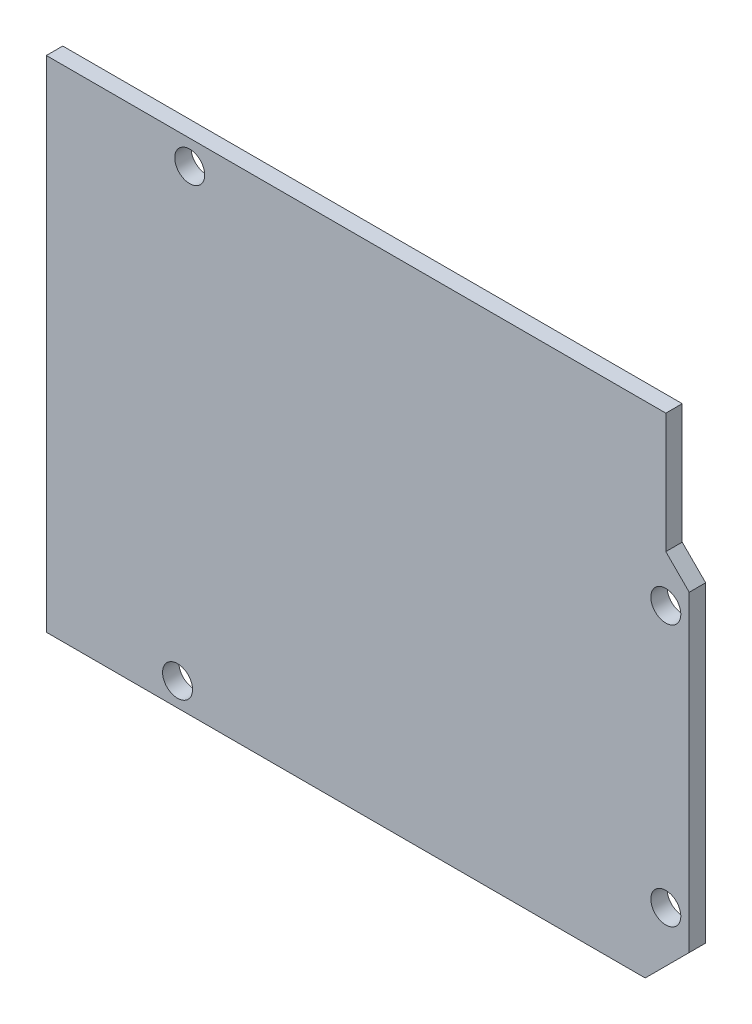
ISO-10303-21;
HEADER;
FILE_DESCRIPTION(('STEP AP214'),'2;1');
FILE_NAME('part.step','',(''),(''),'','','');
FILE_SCHEMA(('AUTOMOTIVE_DESIGN { 1 0 10303 214 1 1 1 1 }'));
ENDSEC;
DATA;
#1=APPLICATION_CONTEXT('core data for automotive mechanical design processes');
#2=APPLICATION_PROTOCOL_DEFINITION('international standard','automotive_design',2000,#1);
#3=PRODUCT_CONTEXT('',#1,'mechanical');
#4=PRODUCT('Part','Part','',(#3));
#5=PRODUCT_RELATED_PRODUCT_CATEGORY('part','',(#4));
#6=PRODUCT_DEFINITION_FORMATION('','',#4);
#7=PRODUCT_DEFINITION_CONTEXT('part definition',#1,'design');
#8=PRODUCT_DEFINITION('design','',#6,#7);
#9=PRODUCT_DEFINITION_SHAPE('','',#8);
#10=(LENGTH_UNIT() NAMED_UNIT(*) SI_UNIT(.MILLI.,.METRE.));
#11=(NAMED_UNIT(*) PLANE_ANGLE_UNIT() SI_UNIT($,.RADIAN.));
#12=(NAMED_UNIT(*) SI_UNIT($,.STERADIAN.) SOLID_ANGLE_UNIT());
#13=UNCERTAINTY_MEASURE_WITH_UNIT(LENGTH_MEASURE(1.E-05),#10,'distance_accuracy_value','');
#14=(GEOMETRIC_REPRESENTATION_CONTEXT(3) GLOBAL_UNCERTAINTY_ASSIGNED_CONTEXT((#13)) GLOBAL_UNIT_ASSIGNED_CONTEXT((#10,
#11,#12)) REPRESENTATION_CONTEXT('',''));
#15=CARTESIAN_POINT('',(0.,0.,0.));
#16=DIRECTION('',(0.,0.,1.));
#17=DIRECTION('',(1.,0.,0.));
#18=AXIS2_PLACEMENT_3D('',#15,#16,#17);
#19=CARTESIAN_POINT('',(34.3,-26.65,1.75));
#20=DIRECTION('',(-1.,0.,0.));
#21=DIRECTION('',(0.,0.,1.));
#22=AXIS2_PLACEMENT_3D('',#19,#20,#21);
#23=PLANE('',#22);
#24=DIRECTION('',(0.,1.,0.));
#25=VECTOR('',#24,1.);
#26=CARTESIAN_POINT('',(34.3,-26.65,1.75));
#27=LINE('',#26,#25);
#28=CARTESIAN_POINT('',(34.3,-21.9497652203467,1.75));
#29=VERTEX_POINT('',#28);
#30=CARTESIAN_POINT('',(34.3,11.35,1.75));
#31=VERTEX_POINT('',#30);
#32=EDGE_CURVE('E123',#29,#31,#27,.T.);
#33=ORIENTED_EDGE('',*,*,#32,.F.);
#34=DIRECTION('',(0.,0.,-1.));
#35=VECTOR('',#34,1.);
#36=CARTESIAN_POINT('',(34.3,-21.9497652203467,1.75));
#37=LINE('',#36,#35);
#38=CARTESIAN_POINT('',(34.3,-21.9497652203467,0.));
#39=VERTEX_POINT('',#38);
#40=EDGE_CURVE('E161',#29,#39,#37,.T.);
#41=ORIENTED_EDGE('',*,*,#40,.T.);
#42=DIRECTION('',(0.,1.,0.));
#43=VECTOR('',#42,1.);
#44=CARTESIAN_POINT('',(34.3,-26.65,0.));
#45=LINE('',#44,#43);
#46=CARTESIAN_POINT('',(34.3,11.35,0.));
#47=VERTEX_POINT('',#46);
#48=EDGE_CURVE('E112',#39,#47,#45,.T.);
#49=ORIENTED_EDGE('',*,*,#48,.T.);
#50=DIRECTION('',(0.,0.,1.));
#51=VECTOR('',#50,1.);
#52=CARTESIAN_POINT('',(34.3,11.35,1.75));
#53=LINE('',#52,#51);
#54=EDGE_CURVE('E167',#47,#31,#53,.T.);
#55=ORIENTED_EDGE('',*,*,#54,.T.);
#56=EDGE_LOOP('',(#33,#41,#49,#55));
#57=FACE_BOUND('',#56,.T.);
#58=ADVANCED_FACE('F32',(#57),#23,.F.);
#59=CARTESIAN_POINT('',(-34.3,26.65,1.75));
#60=DIRECTION('',(0.,-1.,0.));
#61=DIRECTION('',(0.,0.,-1.));
#62=AXIS2_PLACEMENT_3D('',#59,#60,#61);
#63=PLANE('',#62);
#64=DIRECTION('',(-1.,0.,0.));
#65=VECTOR('',#64,1.);
#66=CARTESIAN_POINT('',(-34.3,26.65,1.75));
#67=LINE('',#66,#65);
#68=CARTESIAN_POINT('',(31.8,26.65,1.75));
#69=VERTEX_POINT('',#68);
#70=CARTESIAN_POINT('',(-34.3,26.65,1.75));
#71=VERTEX_POINT('',#70);
#72=EDGE_CURVE('E105',#69,#71,#67,.T.);
#73=ORIENTED_EDGE('',*,*,#72,.F.);
#74=DIRECTION('',(0.,0.,1.));
#75=VECTOR('',#74,1.);
#76=CARTESIAN_POINT('',(31.8,26.65,0.));
#77=LINE('',#76,#75);
#78=CARTESIAN_POINT('',(31.8,26.65,0.));
#79=VERTEX_POINT('',#78);
#80=EDGE_CURVE('E92',#79,#69,#77,.T.);
#81=ORIENTED_EDGE('',*,*,#80,.F.);
#82=DIRECTION('',(-1.,0.,0.));
#83=VECTOR('',#82,1.);
#84=CARTESIAN_POINT('',(-34.3,26.65,0.));
#85=LINE('',#84,#83);
#86=CARTESIAN_POINT('',(-34.3,26.65,0.));
#87=VERTEX_POINT('',#86);
#88=EDGE_CURVE('E103',#79,#87,#85,.T.);
#89=ORIENTED_EDGE('',*,*,#88,.T.);
#90=DIRECTION('',(0.,0.,-1.));
#91=VECTOR('',#90,1.);
#92=CARTESIAN_POINT('',(-34.3,26.65,1.75));
#93=LINE('',#92,#91);
#94=EDGE_CURVE('E39',#71,#87,#93,.T.);
#95=ORIENTED_EDGE('',*,*,#94,.F.);
#96=EDGE_LOOP('',(#73,#81,#89,#95));
#97=FACE_BOUND('',#96,.T.);
#98=ADVANCED_FACE('F101',(#97),#63,.F.);
#99=CARTESIAN_POINT('',(-34.3,-26.65,1.75));
#100=DIRECTION('',(1.,0.,0.));
#101=DIRECTION('',(0.,0.,-1.));
#102=AXIS2_PLACEMENT_3D('',#99,#100,#101);
#103=PLANE('',#102);
#104=DIRECTION('',(0.,-1.,0.));
#105=VECTOR('',#104,1.);
#106=CARTESIAN_POINT('',(-34.3,-26.65,0.));
#107=LINE('',#106,#105);
#108=CARTESIAN_POINT('',(-34.3,-26.65,0.));
#109=VERTEX_POINT('',#108);
#110=EDGE_CURVE('E111',#87,#109,#107,.T.);
#111=ORIENTED_EDGE('',*,*,#110,.T.);
#112=DIRECTION('',(0.,0.,-1.));
#113=VECTOR('',#112,1.);
#114=CARTESIAN_POINT('',(-34.3,-26.65,1.75));
#115=LINE('',#114,#113);
#116=CARTESIAN_POINT('',(-34.3,-26.65,1.75));
#117=VERTEX_POINT('',#116);
#118=EDGE_CURVE('E124',#117,#109,#115,.T.);
#119=ORIENTED_EDGE('',*,*,#118,.F.);
#120=DIRECTION('',(0.,-1.,0.));
#121=VECTOR('',#120,1.);
#122=CARTESIAN_POINT('',(-34.3,-26.65,1.75));
#123=LINE('',#122,#121);
#124=EDGE_CURVE('E131',#71,#117,#123,.T.);
#125=ORIENTED_EDGE('',*,*,#124,.F.);
#126=ORIENTED_EDGE('',*,*,#94,.T.);
#127=EDGE_LOOP('',(#111,#119,#125,#126));
#128=FACE_BOUND('',#127,.T.);
#129=ADVANCED_FACE('F129',(#128),#103,.F.);
#130=CARTESIAN_POINT('',(-34.3,-26.65,1.75));
#131=DIRECTION('',(0.,1.,0.));
#132=DIRECTION('',(0.,0.,1.));
#133=AXIS2_PLACEMENT_3D('',#130,#131,#132);
#134=PLANE('',#133);
#135=DIRECTION('',(1.,0.,0.));
#136=VECTOR('',#135,1.);
#137=CARTESIAN_POINT('',(-34.3,-26.65,0.));
#138=LINE('',#137,#136);
#139=CARTESIAN_POINT('',(29.5997652203467,-26.65,0.));
#140=VERTEX_POINT('',#139);
#141=EDGE_CURVE('E114',#109,#140,#138,.T.);
#142=ORIENTED_EDGE('',*,*,#141,.T.);
#143=DIRECTION('',(0.,0.,1.));
#144=VECTOR('',#143,1.);
#145=CARTESIAN_POINT('',(29.5997652203467,-26.65,1.75));
#146=LINE('',#145,#144);
#147=CARTESIAN_POINT('',(29.5997652203467,-26.65,1.75));
#148=VERTEX_POINT('',#147);
#149=EDGE_CURVE('E53',#140,#148,#146,.T.);
#150=ORIENTED_EDGE('',*,*,#149,.T.);
#151=DIRECTION('',(1.,0.,0.));
#152=VECTOR('',#151,1.);
#153=CARTESIAN_POINT('',(-34.3,-26.65,1.75));
#154=LINE('',#153,#152);
#155=EDGE_CURVE('E126',#117,#148,#154,.T.);
#156=ORIENTED_EDGE('',*,*,#155,.F.);
#157=ORIENTED_EDGE('',*,*,#118,.T.);
#158=EDGE_LOOP('',(#142,#150,#156,#157));
#159=FACE_BOUND('',#158,.T.);
#160=ADVANCED_FACE('F184',(#159),#134,.F.);
#161=CARTESIAN_POINT('',(0.,0.,1.75));
#162=DIRECTION('',(0.,0.,-1.));
#163=DIRECTION('',(-1.,0.,0.));
#164=AXIS2_PLACEMENT_3D('',#161,#162,#163);
#165=PLANE('',#164);
#166=CARTESIAN_POINT('',(31.8,-19.05,1.75));
#167=DIRECTION('',(0.,0.,1.));
#168=DIRECTION('',(1.,0.,0.));
#169=AXIS2_PLACEMENT_3D('',#166,#167,#168);
#170=CIRCLE('',#169,1.6);
#171=CARTESIAN_POINT('',(33.4,-19.05,1.75));
#172=VERTEX_POINT('',#171);
#173=EDGE_CURVE('E158',#172,#172,#170,.T.);
#174=ORIENTED_EDGE('',*,*,#173,.F.);
#175=EDGE_LOOP('',(#174));
#176=FACE_BOUND('',#175,.T.);
#177=CARTESIAN_POINT('',(31.8,8.84999999999999,1.75));
#178=DIRECTION('',(0.,0.,1.));
#179=DIRECTION('',(1.,0.,0.));
#180=AXIS2_PLACEMENT_3D('',#177,#178,#179);
#181=CIRCLE('',#180,1.6);
#182=CARTESIAN_POINT('',(33.4,8.84999999999999,1.75));
#183=VERTEX_POINT('',#182);
#184=EDGE_CURVE('E152',#183,#183,#181,.T.);
#185=ORIENTED_EDGE('',*,*,#184,.F.);
#186=EDGE_LOOP('',(#185));
#187=FACE_BOUND('',#186,.T.);
#188=CARTESIAN_POINT('',(-20.3,-24.15,1.75));
#189=DIRECTION('',(0.,0.,1.));
#190=DIRECTION('',(1.,0.,0.));
#191=AXIS2_PLACEMENT_3D('',#188,#189,#190);
#192=CIRCLE('',#191,1.6);
#193=CARTESIAN_POINT('',(-18.7,-24.15,1.75));
#194=VERTEX_POINT('',#193);
#195=EDGE_CURVE('E146',#194,#194,#192,.T.);
#196=ORIENTED_EDGE('',*,*,#195,.F.);
#197=EDGE_LOOP('',(#196));
#198=FACE_BOUND('',#197,.T.);
#199=CARTESIAN_POINT('',(-19.,24.05,1.75));
#200=DIRECTION('',(0.,0.,1.));
#201=DIRECTION('',(1.,0.,0.));
#202=AXIS2_PLACEMENT_3D('',#199,#200,#201);
#203=CIRCLE('',#202,1.6);
#204=CARTESIAN_POINT('',(-17.4,24.05,1.75));
#205=VERTEX_POINT('',#204);
#206=EDGE_CURVE('E140',#205,#205,#203,.T.);
#207=ORIENTED_EDGE('',*,*,#206,.F.);
#208=EDGE_LOOP('',(#207));
#209=FACE_BOUND('',#208,.T.);
#210=ORIENTED_EDGE('',*,*,#155,.T.);
#211=DIRECTION('',(-0.707106781186546,-0.707106781186549,0.));
#212=VECTOR('',#211,1.);
#213=CARTESIAN_POINT('',(50.9498826101734,-5.29988261017329,1.75));
#214=LINE('',#213,#212);
#215=EDGE_CURVE('E97',#29,#148,#214,.T.);
#216=ORIENTED_EDGE('',*,*,#215,.F.);
#217=ORIENTED_EDGE('',*,*,#32,.T.);
#218=DIRECTION('',(0.707106781186549,-0.707106781186546,0.));
#219=VECTOR('',#218,1.);
#220=CARTESIAN_POINT('',(31.8,13.85,1.75));
#221=LINE('',#220,#219);
#222=CARTESIAN_POINT('',(31.8,13.85,1.75));
#223=VERTEX_POINT('',#222);
#224=EDGE_CURVE('E172',#223,#31,#221,.T.);
#225=ORIENTED_EDGE('',*,*,#224,.F.);
#226=DIRECTION('',(0.,-1.,0.));
#227=VECTOR('',#226,1.);
#228=CARTESIAN_POINT('',(31.8,26.65,1.75));
#229=LINE('',#228,#227);
#230=EDGE_CURVE('E174',#69,#223,#229,.T.);
#231=ORIENTED_EDGE('',*,*,#230,.F.);
#232=ORIENTED_EDGE('',*,*,#72,.T.);
#233=ORIENTED_EDGE('',*,*,#124,.T.);
#234=EDGE_LOOP('',(#210,#216,#217,#225,#231,#232,#233));
#235=FACE_BOUND('',#234,.T.);
#236=ADVANCED_FACE('F181',(#176,#187,#198,#209,#235),#165,.F.);
#237=CARTESIAN_POINT('',(0.,0.,0.));
#238=DIRECTION('',(0.,0.,-1.));
#239=DIRECTION('',(-1.,0.,0.));
#240=AXIS2_PLACEMENT_3D('',#237,#238,#239);
#241=PLANE('',#240);
#242=DIRECTION('',(0.707106781186546,0.707106781186549,0.));
#243=VECTOR('',#242,1.);
#244=CARTESIAN_POINT('',(28.1248826101734,-28.1248826101733,0.));
#245=LINE('',#244,#243);
#246=EDGE_CURVE('E11',#140,#39,#245,.T.);
#247=ORIENTED_EDGE('',*,*,#246,.F.);
#248=ORIENTED_EDGE('',*,*,#141,.F.);
#249=ORIENTED_EDGE('',*,*,#110,.F.);
#250=ORIENTED_EDGE('',*,*,#88,.F.);
#251=DIRECTION('',(0.,-1.,0.));
#252=VECTOR('',#251,1.);
#253=CARTESIAN_POINT('',(31.8,26.65,0.));
#254=LINE('',#253,#252);
#255=CARTESIAN_POINT('',(31.8,13.85,0.));
#256=VERTEX_POINT('',#255);
#257=EDGE_CURVE('E88',#79,#256,#254,.T.);
#258=ORIENTED_EDGE('',*,*,#257,.T.);
#259=DIRECTION('',(0.707106781186549,-0.707106781186546,0.));
#260=VECTOR('',#259,1.);
#261=CARTESIAN_POINT('',(31.8,13.85,0.));
#262=LINE('',#261,#260);
#263=EDGE_CURVE('E46',#256,#47,#262,.T.);
#264=ORIENTED_EDGE('',*,*,#263,.T.);
#265=ORIENTED_EDGE('',*,*,#48,.F.);
#266=EDGE_LOOP('',(#247,#248,#249,#250,#258,#264,#265));
#267=FACE_BOUND('',#266,.T.);
#268=CARTESIAN_POINT('',(31.8,-19.05,0.));
#269=DIRECTION('',(0.,0.,1.));
#270=DIRECTION('',(1.,0.,0.));
#271=AXIS2_PLACEMENT_3D('',#268,#269,#270);
#272=CIRCLE('',#271,1.6);
#273=CARTESIAN_POINT('',(33.4,-19.05,0.));
#274=VERTEX_POINT('',#273);
#275=EDGE_CURVE('E155',#274,#274,#272,.T.);
#276=ORIENTED_EDGE('',*,*,#275,.T.);
#277=EDGE_LOOP('',(#276));
#278=FACE_BOUND('',#277,.T.);
#279=CARTESIAN_POINT('',(31.8,8.84999999999999,0.));
#280=DIRECTION('',(0.,0.,1.));
#281=DIRECTION('',(1.,0.,0.));
#282=AXIS2_PLACEMENT_3D('',#279,#280,#281);
#283=CIRCLE('',#282,1.6);
#284=CARTESIAN_POINT('',(33.4,8.84999999999999,0.));
#285=VERTEX_POINT('',#284);
#286=EDGE_CURVE('E149',#285,#285,#283,.T.);
#287=ORIENTED_EDGE('',*,*,#286,.T.);
#288=EDGE_LOOP('',(#287));
#289=FACE_BOUND('',#288,.T.);
#290=CARTESIAN_POINT('',(-20.3,-24.15,0.));
#291=DIRECTION('',(0.,0.,1.));
#292=DIRECTION('',(1.,0.,0.));
#293=AXIS2_PLACEMENT_3D('',#290,#291,#292);
#294=CIRCLE('',#293,1.6);
#295=CARTESIAN_POINT('',(-18.7,-24.15,0.));
#296=VERTEX_POINT('',#295);
#297=EDGE_CURVE('E143',#296,#296,#294,.T.);
#298=ORIENTED_EDGE('',*,*,#297,.T.);
#299=EDGE_LOOP('',(#298));
#300=FACE_BOUND('',#299,.T.);
#301=CARTESIAN_POINT('',(-19.,24.05,0.));
#302=DIRECTION('',(0.,0.,1.));
#303=DIRECTION('',(1.,0.,0.));
#304=AXIS2_PLACEMENT_3D('',#301,#302,#303);
#305=CIRCLE('',#304,1.6);
#306=CARTESIAN_POINT('',(-17.4,24.05,0.));
#307=VERTEX_POINT('',#306);
#308=EDGE_CURVE('E117',#307,#307,#305,.T.);
#309=ORIENTED_EDGE('',*,*,#308,.T.);
#310=EDGE_LOOP('',(#309));
#311=FACE_BOUND('',#310,.T.);
#312=ADVANCED_FACE('F108',(#267,#278,#289,#300,#311),#241,.T.);
#313=CARTESIAN_POINT('',(-19.,24.05,0.));
#314=DIRECTION('',(0.,0.,1.));
#315=DIRECTION('',(1.,0.,0.));
#316=AXIS2_PLACEMENT_3D('',#313,#314,#315);
#317=CYLINDRICAL_SURFACE('',#316,1.6);
#318=ORIENTED_EDGE('',*,*,#308,.F.);
#319=EDGE_LOOP('',(#318));
#320=FACE_BOUND('',#319,.T.);
#321=ORIENTED_EDGE('',*,*,#206,.T.);
#322=EDGE_LOOP('',(#321));
#323=FACE_BOUND('',#322,.T.);
#324=ADVANCED_FACE('F211',(#320,#323),#317,.F.);
#325=CARTESIAN_POINT('',(-20.3,-24.15,0.));
#326=DIRECTION('',(0.,0.,1.));
#327=DIRECTION('',(1.,0.,0.));
#328=AXIS2_PLACEMENT_3D('',#325,#326,#327);
#329=CYLINDRICAL_SURFACE('',#328,1.6);
#330=ORIENTED_EDGE('',*,*,#297,.F.);
#331=EDGE_LOOP('',(#330));
#332=FACE_BOUND('',#331,.T.);
#333=ORIENTED_EDGE('',*,*,#195,.T.);
#334=EDGE_LOOP('',(#333));
#335=FACE_BOUND('',#334,.T.);
#336=ADVANCED_FACE('F216',(#332,#335),#329,.F.);
#337=CARTESIAN_POINT('',(31.8,8.84999999999999,0.));
#338=DIRECTION('',(0.,0.,1.));
#339=DIRECTION('',(1.,0.,0.));
#340=AXIS2_PLACEMENT_3D('',#337,#338,#339);
#341=CYLINDRICAL_SURFACE('',#340,1.6);
#342=ORIENTED_EDGE('',*,*,#286,.F.);
#343=EDGE_LOOP('',(#342));
#344=FACE_BOUND('',#343,.T.);
#345=ORIENTED_EDGE('',*,*,#184,.T.);
#346=EDGE_LOOP('',(#345));
#347=FACE_BOUND('',#346,.T.);
#348=ADVANCED_FACE('F228',(#344,#347),#341,.F.);
#349=CARTESIAN_POINT('',(31.8,-19.05,0.));
#350=DIRECTION('',(0.,0.,1.));
#351=DIRECTION('',(1.,0.,0.));
#352=AXIS2_PLACEMENT_3D('',#349,#350,#351);
#353=CYLINDRICAL_SURFACE('',#352,1.6);
#354=ORIENTED_EDGE('',*,*,#275,.F.);
#355=EDGE_LOOP('',(#354));
#356=FACE_BOUND('',#355,.T.);
#357=ORIENTED_EDGE('',*,*,#173,.T.);
#358=EDGE_LOOP('',(#357));
#359=FACE_BOUND('',#358,.T.);
#360=ADVANCED_FACE('F238',(#356,#359),#353,.F.);
#361=CARTESIAN_POINT('',(31.8,26.65,0.));
#362=DIRECTION('',(-1.,0.,0.));
#363=DIRECTION('',(0.,-1.,0.));
#364=AXIS2_PLACEMENT_3D('',#361,#362,#363);
#365=PLANE('',#364);
#366=ORIENTED_EDGE('',*,*,#230,.T.);
#367=DIRECTION('',(0.,0.,1.));
#368=VECTOR('',#367,1.);
#369=CARTESIAN_POINT('',(31.8,13.85,0.));
#370=LINE('',#369,#368);
#371=EDGE_CURVE('E94',#256,#223,#370,.T.);
#372=ORIENTED_EDGE('',*,*,#371,.F.);
#373=ORIENTED_EDGE('',*,*,#257,.F.);
#374=ORIENTED_EDGE('',*,*,#80,.T.);
#375=EDGE_LOOP('',(#366,#372,#373,#374));
#376=FACE_BOUND('',#375,.T.);
#377=ADVANCED_FACE('F91',(#376),#365,.F.);
#378=CARTESIAN_POINT('',(31.8,13.85,0.));
#379=DIRECTION('',(-0.707106781186546,-0.707106781186549,0.));
#380=DIRECTION('',(0.707106781186549,-0.707106781186546,0.));
#381=AXIS2_PLACEMENT_3D('',#378,#379,#380);
#382=PLANE('',#381);
#383=ORIENTED_EDGE('',*,*,#263,.F.);
#384=ORIENTED_EDGE('',*,*,#371,.T.);
#385=ORIENTED_EDGE('',*,*,#224,.T.);
#386=ORIENTED_EDGE('',*,*,#54,.F.);
#387=EDGE_LOOP('',(#383,#384,#385,#386));
#388=FACE_BOUND('',#387,.T.);
#389=ADVANCED_FACE('F263',(#388),#382,.F.);
#390=CARTESIAN_POINT('',(50.9498826101734,-5.29988261017329,0.));
#391=DIRECTION('',(-0.707106781186549,0.707106781186546,0.));
#392=DIRECTION('',(-0.707106781186546,-0.707106781186549,0.));
#393=AXIS2_PLACEMENT_3D('',#390,#391,#392);
#394=PLANE('',#393);
#395=ORIENTED_EDGE('',*,*,#215,.T.);
#396=ORIENTED_EDGE('',*,*,#149,.F.);
#397=ORIENTED_EDGE('',*,*,#246,.T.);
#398=ORIENTED_EDGE('',*,*,#40,.F.);
#399=EDGE_LOOP('',(#395,#396,#397,#398));
#400=FACE_BOUND('',#399,.T.);
#401=ADVANCED_FACE('F180',(#400),#394,.F.);
#402=CLOSED_SHELL('',(#58,#98,#129,#160,#236,#312,#324,#336,#348,#360,#377,#389,#401));
#403=MANIFOLD_SOLID_BREP('B2',#402);
#404=ADVANCED_BREP_SHAPE_REPRESENTATION('',(#18,#403),#14);
#405=SHAPE_DEFINITION_REPRESENTATION(#9,#404);
ENDSEC;
END-ISO-10303-21;
